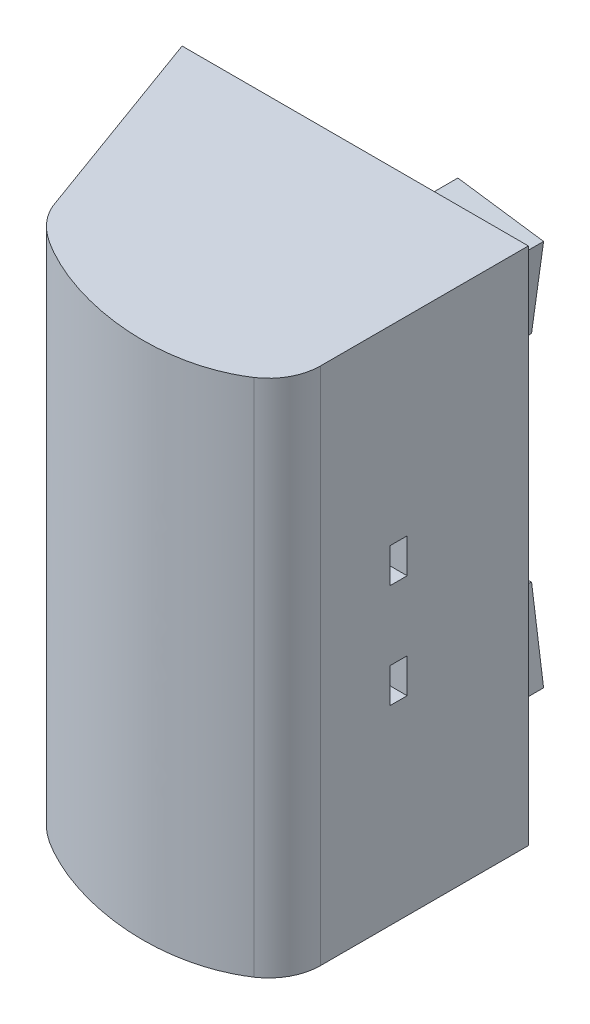
ISO-10303-21;
HEADER;
FILE_DESCRIPTION(('STEP AP214'),'2;1');
FILE_NAME('part.step','',(''),(''),'','','');
FILE_SCHEMA(('AUTOMOTIVE_DESIGN { 1 0 10303 214 1 1 1 1 }'));
ENDSEC;
DATA;
#1=APPLICATION_CONTEXT('core data for automotive mechanical design processes');
#2=APPLICATION_PROTOCOL_DEFINITION('international standard','automotive_design',2000,#1);
#3=PRODUCT_CONTEXT('',#1,'mechanical');
#4=PRODUCT('Part','Part','',(#3));
#5=PRODUCT_RELATED_PRODUCT_CATEGORY('part','',(#4));
#6=PRODUCT_DEFINITION_FORMATION('','',#4);
#7=PRODUCT_DEFINITION_CONTEXT('part definition',#1,'design');
#8=PRODUCT_DEFINITION('design','',#6,#7);
#9=PRODUCT_DEFINITION_SHAPE('','',#8);
#10=(LENGTH_UNIT() NAMED_UNIT(*) SI_UNIT(.MILLI.,.METRE.));
#11=(NAMED_UNIT(*) PLANE_ANGLE_UNIT() SI_UNIT($,.RADIAN.));
#12=(NAMED_UNIT(*) SI_UNIT($,.STERADIAN.) SOLID_ANGLE_UNIT());
#13=UNCERTAINTY_MEASURE_WITH_UNIT(LENGTH_MEASURE(1.E-05),#10,'distance_accuracy_value','');
#14=(GEOMETRIC_REPRESENTATION_CONTEXT(3) GLOBAL_UNCERTAINTY_ASSIGNED_CONTEXT((#13)) GLOBAL_UNIT_ASSIGNED_CONTEXT((#10,
#11,#12)) REPRESENTATION_CONTEXT('',''));
#15=CARTESIAN_POINT('',(0.,0.,0.));
#16=DIRECTION('',(0.,0.,1.));
#17=DIRECTION('',(1.,0.,0.));
#18=AXIS2_PLACEMENT_3D('',#15,#16,#17);
#19=CARTESIAN_POINT('',(0.,60.,0.));
#20=DIRECTION('',(0.,0.,-1.));
#21=DIRECTION('',(-1.,0.,0.));
#22=AXIS2_PLACEMENT_3D('',#19,#20,#21);
#23=PLANE('',#22);
#24=CARTESIAN_POINT('',(34.,24.,0.));
#25=DIRECTION('',(0.,0.,1.));
#26=DIRECTION('',(1.,0.,0.));
#27=AXIS2_PLACEMENT_3D('',#24,#25,#26);
#28=CIRCLE('',#27,2.6);
#29=CARTESIAN_POINT('',(36.6,24.,0.));
#30=VERTEX_POINT('',#29);
#31=EDGE_CURVE('E448',#30,#30,#28,.T.);
#32=ORIENTED_EDGE('',*,*,#31,.T.);
#33=EDGE_LOOP('',(#32));
#34=FACE_BOUND('',#33,.T.);
#35=CARTESIAN_POINT('',(34.,36.,0.));
#36=DIRECTION('',(0.,0.,1.));
#37=DIRECTION('',(1.,0.,0.));
#38=AXIS2_PLACEMENT_3D('',#35,#36,#37);
#39=CIRCLE('',#38,2.6);
#40=CARTESIAN_POINT('',(36.6,36.,0.));
#41=VERTEX_POINT('',#40);
#42=EDGE_CURVE('E453',#41,#41,#39,.T.);
#43=ORIENTED_EDGE('',*,*,#42,.T.);
#44=EDGE_LOOP('',(#43));
#45=FACE_BOUND('',#44,.T.);
#46=DIRECTION('',(1.,0.,0.));
#47=VECTOR('',#46,1.);
#48=CARTESIAN_POINT('',(0.,0.,0.));
#49=LINE('',#48,#47);
#50=CARTESIAN_POINT('',(0.,0.,0.));
#51=VERTEX_POINT('',#50);
#52=CARTESIAN_POINT('',(40.,0.,0.));
#53=VERTEX_POINT('',#52);
#54=EDGE_CURVE('E313',#51,#53,#49,.T.);
#55=ORIENTED_EDGE('',*,*,#54,.F.);
#56=DIRECTION('',(0.,-1.,0.));
#57=VECTOR('',#56,1.);
#58=CARTESIAN_POINT('',(0.,60.,0.));
#59=LINE('',#58,#57);
#60=CARTESIAN_POINT('',(0.,60.,0.));
#61=VERTEX_POINT('',#60);
#62=EDGE_CURVE('E500',#61,#51,#59,.T.);
#63=ORIENTED_EDGE('',*,*,#62,.F.);
#64=DIRECTION('',(1.,0.,0.));
#65=VECTOR('',#64,1.);
#66=CARTESIAN_POINT('',(0.,60.,0.));
#67=LINE('',#66,#65);
#68=CARTESIAN_POINT('',(40.,60.,0.));
#69=VERTEX_POINT('',#68);
#70=EDGE_CURVE('E502',#61,#69,#67,.T.);
#71=ORIENTED_EDGE('',*,*,#70,.T.);
#72=DIRECTION('',(0.,-1.,0.));
#73=VECTOR('',#72,1.);
#74=CARTESIAN_POINT('',(40.,60.,0.));
#75=LINE('',#74,#73);
#76=EDGE_CURVE('E498',#69,#53,#75,.T.);
#77=ORIENTED_EDGE('',*,*,#76,.T.);
#78=EDGE_LOOP('',(#55,#63,#71,#77));
#79=FACE_BOUND('',#78,.T.);
#80=DIRECTION('',(0.139173100960059,-0.990268068741571,0.));
#81=VECTOR('',#80,1.);
#82=CARTESIAN_POINT('',(31.3691003651649,17.5712857341904,0.));
#83=LINE('',#82,#81);
#84=CARTESIAN_POINT('',(31.3691003651649,17.5712857341904,0.));
#85=VERTEX_POINT('',#84);
#86=CARTESIAN_POINT('',(32.7608313747655,7.66860504677466,0.));
#87=VERTEX_POINT('',#86);
#88=EDGE_CURVE('E209',#85,#87,#83,.T.);
#89=ORIENTED_EDGE('',*,*,#88,.F.);
#90=DIRECTION('',(0.990268068741571,0.13917310096006,0.));
#91=VECTOR('',#90,1.);
#92=CARTESIAN_POINT('',(31.3691003651649,17.5712857341904,0.));
#93=LINE('',#92,#91);
#94=CARTESIAN_POINT('',(21.4664196777491,16.1795547245898,0.));
#95=VERTEX_POINT('',#94);
#96=EDGE_CURVE('E206',#95,#85,#93,.T.);
#97=ORIENTED_EDGE('',*,*,#96,.F.);
#98=DIRECTION('',(-0.139173100960059,0.990268068741571,0.));
#99=VECTOR('',#98,1.);
#100=CARTESIAN_POINT('',(21.4664196777491,16.1795547245898,0.));
#101=LINE('',#100,#99);
#102=CARTESIAN_POINT('',(22.8581506873497,6.27687403717406,0.));
#103=VERTEX_POINT('',#102);
#104=EDGE_CURVE('E218',#103,#95,#101,.T.);
#105=ORIENTED_EDGE('',*,*,#104,.F.);
#106=DIRECTION('',(-0.990268068741571,-0.139173100960059,0.));
#107=VECTOR('',#106,1.);
#108=CARTESIAN_POINT('',(22.8581506873497,6.27687403717406,0.));
#109=LINE('',#108,#107);
#110=EDGE_CURVE('E226',#87,#103,#109,.T.);
#111=ORIENTED_EDGE('',*,*,#110,.F.);
#112=EDGE_LOOP('',(#89,#97,#105,#111));
#113=FACE_BOUND('',#112,.T.);
#114=DIRECTION('',(0.139173100960059,0.990268068741571,0.));
#115=VECTOR('',#114,1.);
#116=CARTESIAN_POINT('',(21.4664196777491,43.8204452754102,0.));
#117=LINE('',#116,#115);
#118=CARTESIAN_POINT('',(21.4664196777491,43.8204452754102,0.));
#119=VERTEX_POINT('',#118);
#120=CARTESIAN_POINT('',(22.8581506873497,53.7231259628259,0.));
#121=VERTEX_POINT('',#120);
#122=EDGE_CURVE('E466',#119,#121,#117,.T.);
#123=ORIENTED_EDGE('',*,*,#122,.F.);
#124=DIRECTION('',(-0.990268068741571,0.13917310096006,0.));
#125=VECTOR('',#124,1.);
#126=CARTESIAN_POINT('',(31.3691003651649,42.4287142658096,0.));
#127=LINE('',#126,#125);
#128=CARTESIAN_POINT('',(31.3691003651649,42.4287142658096,0.));
#129=VERTEX_POINT('',#128);
#130=EDGE_CURVE('E204',#129,#119,#127,.T.);
#131=ORIENTED_EDGE('',*,*,#130,.F.);
#132=DIRECTION('',(-0.139173100960059,-0.990268068741571,0.));
#133=VECTOR('',#132,1.);
#134=CARTESIAN_POINT('',(31.3691003651649,42.4287142658096,0.));
#135=LINE('',#134,#133);
#136=CARTESIAN_POINT('',(32.7608313747655,52.3313949532253,0.));
#137=VERTEX_POINT('',#136);
#138=EDGE_CURVE('E200',#137,#129,#135,.T.);
#139=ORIENTED_EDGE('',*,*,#138,.F.);
#140=DIRECTION('',(0.990268068741571,-0.139173100960059,0.));
#141=VECTOR('',#140,1.);
#142=CARTESIAN_POINT('',(22.8581506873497,53.7231259628259,0.));
#143=LINE('',#142,#141);
#144=EDGE_CURVE('E468',#121,#137,#143,.T.);
#145=ORIENTED_EDGE('',*,*,#144,.F.);
#146=EDGE_LOOP('',(#123,#131,#139,#145));
#147=FACE_BOUND('',#146,.T.);
#148=ADVANCED_FACE('F35',(#34,#45,#79,#113,#147),#23,.T.);
#149=CARTESIAN_POINT('',(34.,24.,20.));
#150=DIRECTION('',(0.,0.,-1.));
#151=DIRECTION('',(-1.,0.,0.));
#152=AXIS2_PLACEMENT_3D('',#149,#150,#151);
#153=CYLINDRICAL_SURFACE('',#152,1.6);
#154=CARTESIAN_POINT('',(34.,24.,14.));
#155=DIRECTION('',(0.,0.,-1.));
#156=DIRECTION('',(0.,1.,0.));
#157=AXIS2_PLACEMENT_3D('',#154,#155,#156);
#158=CIRCLE('',#157,1.6);
#159=CARTESIAN_POINT('',(34.,25.6,14.));
#160=VERTEX_POINT('',#159);
#161=EDGE_CURVE('E39',#160,#160,#158,.F.);
#162=ORIENTED_EDGE('',*,*,#161,.T.);
#163=EDGE_LOOP('',(#162));
#164=FACE_BOUND('',#163,.T.);
#165=CARTESIAN_POINT('',(34.,24.,-2.));
#166=DIRECTION('',(0.,0.,1.));
#167=DIRECTION('',(1.,0.,0.));
#168=AXIS2_PLACEMENT_3D('',#165,#166,#167);
#169=CIRCLE('',#168,1.6);
#170=CARTESIAN_POINT('',(35.6,24.,-2.));
#171=VERTEX_POINT('',#170);
#172=EDGE_CURVE('E451',#171,#171,#169,.T.);
#173=ORIENTED_EDGE('',*,*,#172,.F.);
#174=EDGE_LOOP('',(#173));
#175=FACE_BOUND('',#174,.T.);
#176=ADVANCED_FACE('F338',(#164,#175),#153,.F.);
#177=CARTESIAN_POINT('',(34.,36.,20.));
#178=DIRECTION('',(0.,0.,-1.));
#179=DIRECTION('',(-1.,0.,0.));
#180=AXIS2_PLACEMENT_3D('',#177,#178,#179);
#181=CYLINDRICAL_SURFACE('',#180,1.6);
#182=CARTESIAN_POINT('',(34.,36.,14.));
#183=DIRECTION('',(0.,0.,-1.));
#184=DIRECTION('',(-1.,0.,0.));
#185=AXIS2_PLACEMENT_3D('',#182,#183,#184);
#186=CIRCLE('',#185,1.6);
#187=CARTESIAN_POINT('',(32.4,36.,14.));
#188=VERTEX_POINT('',#187);
#189=EDGE_CURVE('E487',#188,#188,#186,.F.);
#190=ORIENTED_EDGE('',*,*,#189,.T.);
#191=EDGE_LOOP('',(#190));
#192=FACE_BOUND('',#191,.T.);
#193=CARTESIAN_POINT('',(34.,36.,-2.));
#194=DIRECTION('',(0.,0.,1.));
#195=DIRECTION('',(1.,0.,0.));
#196=AXIS2_PLACEMENT_3D('',#193,#194,#195);
#197=CIRCLE('',#196,1.6);
#198=CARTESIAN_POINT('',(35.6,36.,-2.));
#199=VERTEX_POINT('',#198);
#200=EDGE_CURVE('E456',#199,#199,#197,.T.);
#201=ORIENTED_EDGE('',*,*,#200,.F.);
#202=EDGE_LOOP('',(#201));
#203=FACE_BOUND('',#202,.T.);
#204=ADVANCED_FACE('F362',(#192,#203),#181,.F.);
#205=CARTESIAN_POINT('',(0.,60.,0.));
#206=DIRECTION('',(0.939692620785909,0.,-0.342020143325666));
#207=DIRECTION('',(-0.342020143325666,0.,-0.939692620785909));
#208=AXIS2_PLACEMENT_3D('',#205,#206,#207);
#209=PLANE('',#208);
#210=DIRECTION('',(0.342020143325666,0.,0.93969262078591));
#211=VECTOR('',#210,1.);
#212=CARTESIAN_POINT('',(0.,0.,0.));
#213=LINE('',#212,#211);
#214=CARTESIAN_POINT('',(8.55050358314165,0.,23.4923155196477));
#215=VERTEX_POINT('',#214);
#216=EDGE_CURVE('E305',#51,#215,#213,.T.);
#217=ORIENTED_EDGE('',*,*,#216,.T.);
#218=DIRECTION('',(0.,-1.,0.));
#219=VECTOR('',#218,1.);
#220=CARTESIAN_POINT('',(8.55050358314165,60.,23.4923155196477));
#221=LINE('',#220,#219);
#222=CARTESIAN_POINT('',(8.55050358314165,60.,23.4923155196477));
#223=VERTEX_POINT('',#222);
#224=EDGE_CURVE('E11',#223,#215,#221,.T.);
#225=ORIENTED_EDGE('',*,*,#224,.F.);
#226=DIRECTION('',(0.342020143325666,0.,0.93969262078591));
#227=VECTOR('',#226,1.);
#228=CARTESIAN_POINT('',(0.,60.,0.));
#229=LINE('',#228,#227);
#230=EDGE_CURVE('E309',#61,#223,#229,.T.);
#231=ORIENTED_EDGE('',*,*,#230,.F.);
#232=ORIENTED_EDGE('',*,*,#62,.T.);
#233=EDGE_LOOP('',(#217,#225,#231,#232));
#234=FACE_BOUND('',#233,.T.);
#235=ADVANCED_FACE('F37',(#234),#209,.F.);
#236=CARTESIAN_POINT('',(8.55050358314165,60.,23.4923155196477));
#237=CARTESIAN_POINT('',(9.18765074699314,60.,24.9849829137062));
#238=CARTESIAN_POINT('',(10.8690334950303,60.,26.6958688574846));
#239=CARTESIAN_POINT('',(13.5799434538811,60.,28.2755265891306));
#240=CARTESIAN_POINT('',(21.4201873768036,60.,32.0809754041825));
#241=CARTESIAN_POINT('',(31.2886114496521,60.,32.9569638078628));
#242=CARTESIAN_POINT('',(37.3305271650823,60.,28.9953986145493));
#243=B_SPLINE_CURVE_WITH_KNOTS('',3,(#236,#237,#238,#239,#240,#241,#242),.UNSPECIFIED.,.F.,.F.,
(4,1,1,1,4),(0.,0.152199330225797,0.226855665368492,0.301953475738041,1.),.UNSPECIFIED.);
#244=DIRECTION('',(0.,-1.,0.));
#245=VECTOR('',#244,1.);
#246=SURFACE_OF_LINEAR_EXTRUSION('',#243,#245);
#247=CARTESIAN_POINT('',(8.55050358314165,0.,23.4923155196477));
#248=CARTESIAN_POINT('',(9.18765074699314,0.,24.9849829137062));
#249=CARTESIAN_POINT('',(10.8690334950303,0.,26.6958688574846));
#250=CARTESIAN_POINT('',(13.5799434538811,0.,28.2755265891306));
#251=CARTESIAN_POINT('',(21.4201873768036,0.,32.0809754041825));
#252=CARTESIAN_POINT('',(31.2886114496521,0.,32.9569638078628));
#253=CARTESIAN_POINT('',(37.3305271650823,0.,28.9953986145493));
#254=B_SPLINE_CURVE_WITH_KNOTS('',3,(#247,#248,#249,#250,#251,#252,#253),.UNSPECIFIED.,.F.,.F.,
(4,1,1,1,4),(0.,0.152199330225797,0.226855665368492,0.301953475738041,1.),.UNSPECIFIED.);
#255=CARTESIAN_POINT('',(37.3305271650823,0.,28.9953986145493));
#256=VERTEX_POINT('',#255);
#257=EDGE_CURVE('E511',#215,#256,#254,.T.);
#258=ORIENTED_EDGE('',*,*,#257,.T.);
#259=DIRECTION('',(0.,-1.,0.));
#260=VECTOR('',#259,1.);
#261=CARTESIAN_POINT('',(37.3305271650823,60.,28.9953986145493));
#262=LINE('',#261,#260);
#263=CARTESIAN_POINT('',(37.3305271650823,60.,28.9953986145493));
#264=VERTEX_POINT('',#263);
#265=EDGE_CURVE('E44',#264,#256,#262,.T.);
#266=ORIENTED_EDGE('',*,*,#265,.F.);
#267=EDGE_CURVE('E312',#223,#264,#243,.T.);
#268=ORIENTED_EDGE('',*,*,#267,.F.);
#269=ORIENTED_EDGE('',*,*,#224,.T.);
#270=EDGE_LOOP('',(#258,#266,#268,#269));
#271=FACE_BOUND('',#270,.T.);
#272=ADVANCED_FACE('F323',(#271),#246,.F.);
#273=CARTESIAN_POINT('',(34.01,60.,24.01));
#274=DIRECTION('',(0.,-1.,0.));
#275=DIRECTION('',(0.,0.,-1.));
#276=AXIS2_PLACEMENT_3D('',#273,#274,#275);
#277=CYLINDRICAL_SURFACE('',#276,5.99);
#278=CARTESIAN_POINT('',(34.01,0.,24.01));
#279=DIRECTION('',(0.,1.,0.));
#280=DIRECTION('',(0.,0.,1.));
#281=AXIS2_PLACEMENT_3D('',#278,#279,#280);
#282=CIRCLE('',#281,5.99);
#283=CARTESIAN_POINT('',(40.,0.,24.01));
#284=VERTEX_POINT('',#283);
#285=EDGE_CURVE('E508',#284,#256,#282,.F.);
#286=ORIENTED_EDGE('',*,*,#285,.F.);
#287=DIRECTION('',(0.,-1.,0.));
#288=VECTOR('',#287,1.);
#289=CARTESIAN_POINT('',(40.,60.,24.01));
#290=LINE('',#289,#288);
#291=CARTESIAN_POINT('',(40.,60.,24.01));
#292=VERTEX_POINT('',#291);
#293=EDGE_CURVE('E496',#292,#284,#290,.T.);
#294=ORIENTED_EDGE('',*,*,#293,.F.);
#295=CARTESIAN_POINT('',(34.01,60.,24.01));
#296=DIRECTION('',(0.,1.,0.));
#297=DIRECTION('',(0.,0.,1.));
#298=AXIS2_PLACEMENT_3D('',#295,#296,#297);
#299=CIRCLE('',#298,5.99);
#300=EDGE_CURVE('E318',#292,#264,#299,.F.);
#301=ORIENTED_EDGE('',*,*,#300,.T.);
#302=ORIENTED_EDGE('',*,*,#265,.T.);
#303=EDGE_LOOP('',(#286,#294,#301,#302));
#304=FACE_BOUND('',#303,.T.);
#305=ADVANCED_FACE('F326',(#304),#277,.T.);
#306=CARTESIAN_POINT('',(40.,60.,0.));
#307=DIRECTION('',(1.,0.,0.));
#308=DIRECTION('',(0.,0.,-1.));
#309=AXIS2_PLACEMENT_3D('',#306,#307,#308);
#310=PLANE('',#309);
#311=DIRECTION('',(0.,1.,0.));
#312=VECTOR('',#311,1.);
#313=CARTESIAN_POINT('',(40.,34.,14.));
#314=LINE('',#313,#312);
#315=CARTESIAN_POINT('',(40.,34.,14.));
#316=VERTEX_POINT('',#315);
#317=CARTESIAN_POINT('',(40.,38.,14.));
#318=VERTEX_POINT('',#317);
#319=EDGE_CURVE('E252',#316,#318,#314,.T.);
#320=ORIENTED_EDGE('',*,*,#319,.F.);
#321=DIRECTION('',(0.,0.,-1.));
#322=VECTOR('',#321,1.);
#323=CARTESIAN_POINT('',(40.,34.,14.));
#324=LINE('',#323,#322);
#325=CARTESIAN_POINT('',(40.,34.,16.));
#326=VERTEX_POINT('',#325);
#327=EDGE_CURVE('E242',#326,#316,#324,.T.);
#328=ORIENTED_EDGE('',*,*,#327,.F.);
#329=DIRECTION('',(0.,-1.,0.));
#330=VECTOR('',#329,1.);
#331=CARTESIAN_POINT('',(40.,34.,16.));
#332=LINE('',#331,#330);
#333=CARTESIAN_POINT('',(40.,38.,16.));
#334=VERTEX_POINT('',#333);
#335=EDGE_CURVE('E258',#334,#326,#332,.T.);
#336=ORIENTED_EDGE('',*,*,#335,.F.);
#337=DIRECTION('',(0.,0.,1.));
#338=VECTOR('',#337,1.);
#339=CARTESIAN_POINT('',(40.,38.,14.));
#340=LINE('',#339,#338);
#341=EDGE_CURVE('E254',#318,#334,#340,.T.);
#342=ORIENTED_EDGE('',*,*,#341,.F.);
#343=EDGE_LOOP('',(#320,#328,#336,#342));
#344=FACE_BOUND('',#343,.T.);
#345=DIRECTION('',(0.,1.,0.));
#346=VECTOR('',#345,1.);
#347=CARTESIAN_POINT('',(40.,26.,14.));
#348=LINE('',#347,#346);
#349=CARTESIAN_POINT('',(40.,22.,14.));
#350=VERTEX_POINT('',#349);
#351=CARTESIAN_POINT('',(40.,26.,14.));
#352=VERTEX_POINT('',#351);
#353=EDGE_CURVE('E237',#350,#352,#348,.T.);
#354=ORIENTED_EDGE('',*,*,#353,.F.);
#355=DIRECTION('',(0.,0.,-1.));
#356=VECTOR('',#355,1.);
#357=CARTESIAN_POINT('',(40.,22.,14.));
#358=LINE('',#357,#356);
#359=CARTESIAN_POINT('',(40.,22.,16.));
#360=VERTEX_POINT('',#359);
#361=EDGE_CURVE('E276',#360,#350,#358,.T.);
#362=ORIENTED_EDGE('',*,*,#361,.F.);
#363=DIRECTION('',(0.,-1.,0.));
#364=VECTOR('',#363,1.);
#365=CARTESIAN_POINT('',(40.,26.,16.));
#366=LINE('',#365,#364);
#367=CARTESIAN_POINT('',(40.,26.,16.));
#368=VERTEX_POINT('',#367);
#369=EDGE_CURVE('E290',#368,#360,#366,.T.);
#370=ORIENTED_EDGE('',*,*,#369,.F.);
#371=DIRECTION('',(0.,0.,1.));
#372=VECTOR('',#371,1.);
#373=CARTESIAN_POINT('',(40.,26.,14.));
#374=LINE('',#373,#372);
#375=EDGE_CURVE('E287',#352,#368,#374,.T.);
#376=ORIENTED_EDGE('',*,*,#375,.F.);
#377=EDGE_LOOP('',(#354,#362,#370,#376));
#378=FACE_BOUND('',#377,.T.);
#379=DIRECTION('',(0.,0.,1.));
#380=VECTOR('',#379,1.);
#381=CARTESIAN_POINT('',(40.,0.,0.));
#382=LINE('',#381,#380);
#383=EDGE_CURVE('E505',#53,#284,#382,.T.);
#384=ORIENTED_EDGE('',*,*,#383,.F.);
#385=ORIENTED_EDGE('',*,*,#76,.F.);
#386=DIRECTION('',(0.,0.,1.));
#387=VECTOR('',#386,1.);
#388=CARTESIAN_POINT('',(40.,60.,0.));
#389=LINE('',#388,#387);
#390=EDGE_CURVE('E522',#69,#292,#389,.T.);
#391=ORIENTED_EDGE('',*,*,#390,.T.);
#392=ORIENTED_EDGE('',*,*,#293,.T.);
#393=EDGE_LOOP('',(#384,#385,#391,#392));
#394=FACE_BOUND('',#393,.T.);
#395=ADVANCED_FACE('F330',(#344,#378,#394),#310,.T.);
#396=CARTESIAN_POINT('',(0.,60.,0.));
#397=DIRECTION('',(0.,1.,0.));
#398=DIRECTION('',(0.,0.,1.));
#399=AXIS2_PLACEMENT_3D('',#396,#397,#398);
#400=PLANE('',#399);
#401=ORIENTED_EDGE('',*,*,#230,.T.);
#402=ORIENTED_EDGE('',*,*,#267,.T.);
#403=ORIENTED_EDGE('',*,*,#300,.F.);
#404=ORIENTED_EDGE('',*,*,#390,.F.);
#405=ORIENTED_EDGE('',*,*,#70,.F.);
#406=EDGE_LOOP('',(#401,#402,#403,#404,#405));
#407=FACE_BOUND('',#406,.T.);
#408=ADVANCED_FACE('F334',(#407),#400,.T.);
#409=CARTESIAN_POINT('',(0.,0.,0.));
#410=DIRECTION('',(0.,1.,0.));
#411=DIRECTION('',(0.,0.,1.));
#412=AXIS2_PLACEMENT_3D('',#409,#410,#411);
#413=PLANE('',#412);
#414=ORIENTED_EDGE('',*,*,#216,.F.);
#415=ORIENTED_EDGE('',*,*,#54,.T.);
#416=ORIENTED_EDGE('',*,*,#383,.T.);
#417=ORIENTED_EDGE('',*,*,#285,.T.);
#418=ORIENTED_EDGE('',*,*,#257,.F.);
#419=EDGE_LOOP('',(#414,#415,#416,#417,#418));
#420=FACE_BOUND('',#419,.T.);
#421=ADVANCED_FACE('F340',(#420),#413,.F.);
#422=CARTESIAN_POINT('',(30.,34.,14.));
#423=DIRECTION('',(0.,0.,-1.));
#424=DIRECTION('',(-1.,0.,0.));
#425=AXIS2_PLACEMENT_3D('',#422,#423,#424);
#426=PLANE('',#425);
#427=ORIENTED_EDGE('',*,*,#319,.T.);
#428=DIRECTION('',(1.,0.,0.));
#429=VECTOR('',#428,1.);
#430=CARTESIAN_POINT('',(30.,38.,14.));
#431=LINE('',#430,#429);
#432=CARTESIAN_POINT('',(30.,38.,14.));
#433=VERTEX_POINT('',#432);
#434=EDGE_CURVE('E251',#433,#318,#431,.T.);
#435=ORIENTED_EDGE('',*,*,#434,.F.);
#436=DIRECTION('',(0.,1.,0.));
#437=VECTOR('',#436,1.);
#438=CARTESIAN_POINT('',(30.,34.,14.));
#439=LINE('',#438,#437);
#440=CARTESIAN_POINT('',(30.,34.,14.));
#441=VERTEX_POINT('',#440);
#442=EDGE_CURVE('E238',#441,#433,#439,.T.);
#443=ORIENTED_EDGE('',*,*,#442,.F.);
#444=DIRECTION('',(1.,0.,0.));
#445=VECTOR('',#444,1.);
#446=CARTESIAN_POINT('',(30.,34.,14.));
#447=LINE('',#446,#445);
#448=EDGE_CURVE('E263',#441,#316,#447,.T.);
#449=ORIENTED_EDGE('',*,*,#448,.T.);
#450=EDGE_LOOP('',(#427,#435,#443,#449));
#451=FACE_BOUND('',#450,.T.);
#452=ORIENTED_EDGE('',*,*,#189,.F.);
#453=EDGE_LOOP('',(#452));
#454=FACE_BOUND('',#453,.T.);
#455=ADVANCED_FACE('F343',(#451,#454),#426,.F.);
#456=CARTESIAN_POINT('',(30.,34.,16.));
#457=DIRECTION('',(0.,0.,1.));
#458=DIRECTION('',(1.,0.,0.));
#459=AXIS2_PLACEMENT_3D('',#456,#457,#458);
#460=PLANE('',#459);
#461=ORIENTED_EDGE('',*,*,#335,.T.);
#462=DIRECTION('',(1.,0.,0.));
#463=VECTOR('',#462,1.);
#464=CARTESIAN_POINT('',(30.,34.,16.));
#465=LINE('',#464,#463);
#466=CARTESIAN_POINT('',(30.,34.,16.));
#467=VERTEX_POINT('',#466);
#468=EDGE_CURVE('E266',#467,#326,#465,.T.);
#469=ORIENTED_EDGE('',*,*,#468,.F.);
#470=DIRECTION('',(0.,-1.,0.));
#471=VECTOR('',#470,1.);
#472=CARTESIAN_POINT('',(30.,34.,16.));
#473=LINE('',#472,#471);
#474=CARTESIAN_POINT('',(30.,38.,16.));
#475=VERTEX_POINT('',#474);
#476=EDGE_CURVE('E245',#475,#467,#473,.T.);
#477=ORIENTED_EDGE('',*,*,#476,.F.);
#478=DIRECTION('',(1.,0.,0.));
#479=VECTOR('',#478,1.);
#480=CARTESIAN_POINT('',(30.,38.,16.));
#481=LINE('',#480,#479);
#482=EDGE_CURVE('E268',#475,#334,#481,.T.);
#483=ORIENTED_EDGE('',*,*,#482,.T.);
#484=EDGE_LOOP('',(#461,#469,#477,#483));
#485=FACE_BOUND('',#484,.T.);
#486=CARTESIAN_POINT('',(34.,36.,16.));
#487=DIRECTION('',(0.,0.,1.));
#488=DIRECTION('',(1.,0.,0.));
#489=AXIS2_PLACEMENT_3D('',#486,#487,#488);
#490=CIRCLE('',#489,1.6);
#491=CARTESIAN_POINT('',(35.6,36.,16.));
#492=VERTEX_POINT('',#491);
#493=EDGE_CURVE('E265',#492,#492,#490,.F.);
#494=ORIENTED_EDGE('',*,*,#493,.F.);
#495=EDGE_LOOP('',(#494));
#496=FACE_BOUND('',#495,.T.);
#497=ADVANCED_FACE('F389',(#485,#496),#460,.F.);
#498=CARTESIAN_POINT('',(30.,34.,14.));
#499=DIRECTION('',(0.,-1.,0.));
#500=DIRECTION('',(0.,0.,-1.));
#501=AXIS2_PLACEMENT_3D('',#498,#499,#500);
#502=PLANE('',#501);
#503=ORIENTED_EDGE('',*,*,#327,.T.);
#504=ORIENTED_EDGE('',*,*,#448,.F.);
#505=DIRECTION('',(0.,0.,-1.));
#506=VECTOR('',#505,1.);
#507=CARTESIAN_POINT('',(30.,34.,14.));
#508=LINE('',#507,#506);
#509=EDGE_CURVE('E248',#467,#441,#508,.T.);
#510=ORIENTED_EDGE('',*,*,#509,.F.);
#511=ORIENTED_EDGE('',*,*,#468,.T.);
#512=EDGE_LOOP('',(#503,#504,#510,#511));
#513=FACE_BOUND('',#512,.T.);
#514=ADVANCED_FACE('F394',(#513),#502,.F.);
#515=CARTESIAN_POINT('',(30.,38.,14.));
#516=DIRECTION('',(0.,1.,0.));
#517=DIRECTION('',(0.,0.,1.));
#518=AXIS2_PLACEMENT_3D('',#515,#516,#517);
#519=PLANE('',#518);
#520=ORIENTED_EDGE('',*,*,#341,.T.);
#521=ORIENTED_EDGE('',*,*,#482,.F.);
#522=DIRECTION('',(0.,0.,1.));
#523=VECTOR('',#522,1.);
#524=CARTESIAN_POINT('',(30.,38.,14.));
#525=LINE('',#524,#523);
#526=EDGE_CURVE('E241',#433,#475,#525,.T.);
#527=ORIENTED_EDGE('',*,*,#526,.F.);
#528=ORIENTED_EDGE('',*,*,#434,.T.);
#529=EDGE_LOOP('',(#520,#521,#527,#528));
#530=FACE_BOUND('',#529,.T.);
#531=ADVANCED_FACE('F391',(#530),#519,.F.);
#532=CARTESIAN_POINT('',(30.,0.,0.));
#533=DIRECTION('',(1.,0.,0.));
#534=DIRECTION('',(0.,0.,-1.));
#535=AXIS2_PLACEMENT_3D('',#532,#533,#534);
#536=PLANE('',#535);
#537=ORIENTED_EDGE('',*,*,#442,.T.);
#538=ORIENTED_EDGE('',*,*,#526,.T.);
#539=ORIENTED_EDGE('',*,*,#476,.T.);
#540=ORIENTED_EDGE('',*,*,#509,.T.);
#541=EDGE_LOOP('',(#537,#538,#539,#540));
#542=FACE_BOUND('',#541,.T.);
#543=ADVANCED_FACE('F371',(#542),#536,.T.);
#544=CARTESIAN_POINT('',(30.,26.,14.));
#545=DIRECTION('',(0.,0.,-1.));
#546=DIRECTION('',(0.,1.,0.));
#547=AXIS2_PLACEMENT_3D('',#544,#545,#546);
#548=PLANE('',#547);
#549=ORIENTED_EDGE('',*,*,#353,.T.);
#550=DIRECTION('',(1.,0.,0.));
#551=VECTOR('',#550,1.);
#552=CARTESIAN_POINT('',(30.,26.,14.));
#553=LINE('',#552,#551);
#554=CARTESIAN_POINT('',(30.,26.,14.));
#555=VERTEX_POINT('',#554);
#556=EDGE_CURVE('E285',#555,#352,#553,.T.);
#557=ORIENTED_EDGE('',*,*,#556,.F.);
#558=DIRECTION('',(0.,1.,0.));
#559=VECTOR('',#558,1.);
#560=CARTESIAN_POINT('',(30.,26.,14.));
#561=LINE('',#560,#559);
#562=CARTESIAN_POINT('',(30.,22.,14.));
#563=VERTEX_POINT('',#562);
#564=EDGE_CURVE('E272',#563,#555,#561,.T.);
#565=ORIENTED_EDGE('',*,*,#564,.F.);
#566=DIRECTION('',(1.,0.,0.));
#567=VECTOR('',#566,1.);
#568=CARTESIAN_POINT('',(30.,22.,14.));
#569=LINE('',#568,#567);
#570=EDGE_CURVE('E255',#563,#350,#569,.T.);
#571=ORIENTED_EDGE('',*,*,#570,.T.);
#572=EDGE_LOOP('',(#549,#557,#565,#571));
#573=FACE_BOUND('',#572,.T.);
#574=ORIENTED_EDGE('',*,*,#161,.F.);
#575=EDGE_LOOP('',(#574));
#576=FACE_BOUND('',#575,.T.);
#577=ADVANCED_FACE('F367',(#573,#576),#548,.F.);
#578=CARTESIAN_POINT('',(30.,26.,16.));
#579=DIRECTION('',(0.,0.,1.));
#580=DIRECTION('',(0.,-1.,0.));
#581=AXIS2_PLACEMENT_3D('',#578,#579,#580);
#582=PLANE('',#581);
#583=ORIENTED_EDGE('',*,*,#369,.T.);
#584=DIRECTION('',(1.,0.,0.));
#585=VECTOR('',#584,1.);
#586=CARTESIAN_POINT('',(30.,22.,16.));
#587=LINE('',#586,#585);
#588=CARTESIAN_POINT('',(30.,22.,16.));
#589=VERTEX_POINT('',#588);
#590=EDGE_CURVE('E296',#589,#360,#587,.T.);
#591=ORIENTED_EDGE('',*,*,#590,.F.);
#592=DIRECTION('',(0.,-1.,0.));
#593=VECTOR('',#592,1.);
#594=CARTESIAN_POINT('',(30.,26.,16.));
#595=LINE('',#594,#593);
#596=CARTESIAN_POINT('',(30.,26.,16.));
#597=VERTEX_POINT('',#596);
#598=EDGE_CURVE('E279',#597,#589,#595,.T.);
#599=ORIENTED_EDGE('',*,*,#598,.F.);
#600=DIRECTION('',(1.,0.,0.));
#601=VECTOR('',#600,1.);
#602=CARTESIAN_POINT('',(30.,26.,16.));
#603=LINE('',#602,#601);
#604=EDGE_CURVE('E298',#597,#368,#603,.T.);
#605=ORIENTED_EDGE('',*,*,#604,.T.);
#606=EDGE_LOOP('',(#583,#591,#599,#605));
#607=FACE_BOUND('',#606,.T.);
#608=CARTESIAN_POINT('',(34.,24.,16.));
#609=DIRECTION('',(0.,0.,1.));
#610=DIRECTION('',(0.,-1.,0.));
#611=AXIS2_PLACEMENT_3D('',#608,#609,#610);
#612=CIRCLE('',#611,1.6);
#613=CARTESIAN_POINT('',(34.,22.4,16.));
#614=VERTEX_POINT('',#613);
#615=EDGE_CURVE('E489',#614,#614,#612,.F.);
#616=ORIENTED_EDGE('',*,*,#615,.F.);
#617=EDGE_LOOP('',(#616));
#618=FACE_BOUND('',#617,.T.);
#619=ADVANCED_FACE('F370',(#607,#618),#582,.F.);
#620=CARTESIAN_POINT('',(30.,22.,14.));
#621=DIRECTION('',(0.,-1.,0.));
#622=DIRECTION('',(0.,0.,-1.));
#623=AXIS2_PLACEMENT_3D('',#620,#621,#622);
#624=PLANE('',#623);
#625=ORIENTED_EDGE('',*,*,#361,.T.);
#626=ORIENTED_EDGE('',*,*,#570,.F.);
#627=DIRECTION('',(0.,0.,-1.));
#628=VECTOR('',#627,1.);
#629=CARTESIAN_POINT('',(30.,22.,14.));
#630=LINE('',#629,#628);
#631=EDGE_CURVE('E282',#589,#563,#630,.T.);
#632=ORIENTED_EDGE('',*,*,#631,.F.);
#633=ORIENTED_EDGE('',*,*,#590,.T.);
#634=EDGE_LOOP('',(#625,#626,#632,#633));
#635=FACE_BOUND('',#634,.T.);
#636=ADVANCED_FACE('F376',(#635),#624,.F.);
#637=CARTESIAN_POINT('',(30.,26.,14.));
#638=DIRECTION('',(0.,1.,0.));
#639=DIRECTION('',(0.,0.,1.));
#640=AXIS2_PLACEMENT_3D('',#637,#638,#639);
#641=PLANE('',#640);
#642=ORIENTED_EDGE('',*,*,#375,.T.);
#643=ORIENTED_EDGE('',*,*,#604,.F.);
#644=DIRECTION('',(0.,0.,1.));
#645=VECTOR('',#644,1.);
#646=CARTESIAN_POINT('',(30.,26.,14.));
#647=LINE('',#646,#645);
#648=EDGE_CURVE('E275',#555,#597,#647,.T.);
#649=ORIENTED_EDGE('',*,*,#648,.F.);
#650=ORIENTED_EDGE('',*,*,#556,.T.);
#651=EDGE_LOOP('',(#642,#643,#649,#650));
#652=FACE_BOUND('',#651,.T.);
#653=ADVANCED_FACE('F373',(#652),#641,.F.);
#654=CARTESIAN_POINT('',(30.,0.,0.));
#655=DIRECTION('',(-1.,0.,0.));
#656=DIRECTION('',(0.,0.,1.));
#657=AXIS2_PLACEMENT_3D('',#654,#655,#656);
#658=PLANE('',#657);
#659=ORIENTED_EDGE('',*,*,#564,.T.);
#660=ORIENTED_EDGE('',*,*,#648,.T.);
#661=ORIENTED_EDGE('',*,*,#598,.T.);
#662=ORIENTED_EDGE('',*,*,#631,.T.);
#663=EDGE_LOOP('',(#659,#660,#661,#662));
#664=FACE_BOUND('',#663,.T.);
#665=ADVANCED_FACE('F365',(#664),#658,.F.);
#666=CARTESIAN_POINT('',(34.,36.,20.));
#667=DIRECTION('',(0.,0.,-1.));
#668=DIRECTION('',(-1.,0.,0.));
#669=AXIS2_PLACEMENT_3D('',#666,#667,#668);
#670=PLANE('',#669);
#671=CARTESIAN_POINT('',(34.,36.,20.));
#672=DIRECTION('',(0.,0.,-1.));
#673=DIRECTION('',(-1.,0.,0.));
#674=AXIS2_PLACEMENT_3D('',#671,#672,#673);
#675=CIRCLE('',#674,1.6);
#676=CARTESIAN_POINT('',(32.4,36.,20.));
#677=VERTEX_POINT('',#676);
#678=EDGE_CURVE('E302',#677,#677,#675,.T.);
#679=ORIENTED_EDGE('',*,*,#678,.T.);
#680=EDGE_LOOP('',(#679));
#681=FACE_BOUND('',#680,.T.);
#682=ADVANCED_FACE('F360',(#681),#670,.T.);
#683=ORIENTED_EDGE('',*,*,#493,.T.);
#684=EDGE_LOOP('',(#683));
#685=FACE_BOUND('',#684,.T.);
#686=ORIENTED_EDGE('',*,*,#678,.F.);
#687=EDGE_LOOP('',(#686));
#688=FACE_BOUND('',#687,.T.);
#689=ADVANCED_FACE('F356',(#685,#688),#181,.F.);
#690=CARTESIAN_POINT('',(34.,24.,20.));
#691=DIRECTION('',(0.,0.,1.));
#692=DIRECTION('',(1.,0.,0.));
#693=AXIS2_PLACEMENT_3D('',#690,#691,#692);
#694=PLANE('',#693);
#695=CARTESIAN_POINT('',(34.,24.,20.));
#696=DIRECTION('',(0.,0.,-1.));
#697=DIRECTION('',(1.,0.,0.));
#698=AXIS2_PLACEMENT_3D('',#695,#696,#697);
#699=CIRCLE('',#698,1.6);
#700=CARTESIAN_POINT('',(35.6,24.,20.));
#701=VERTEX_POINT('',#700);
#702=EDGE_CURVE('E306',#701,#701,#699,.T.);
#703=ORIENTED_EDGE('',*,*,#702,.T.);
#704=EDGE_LOOP('',(#703));
#705=FACE_BOUND('',#704,.T.);
#706=ADVANCED_FACE('F352',(#705),#694,.F.);
#707=ORIENTED_EDGE('',*,*,#615,.T.);
#708=EDGE_LOOP('',(#707));
#709=FACE_BOUND('',#708,.T.);
#710=ORIENTED_EDGE('',*,*,#702,.F.);
#711=EDGE_LOOP('',(#710));
#712=FACE_BOUND('',#711,.T.);
#713=ADVANCED_FACE('F348',(#709,#712),#153,.F.);
#714=CARTESIAN_POINT('',(31.3691003651649,17.5712857341904,-9.));
#715=DIRECTION('',(0.13917310096006,-0.990268068741571,0.));
#716=DIRECTION('',(0.990268068741571,0.13917310096006,0.));
#717=AXIS2_PLACEMENT_3D('',#714,#715,#716);
#718=PLANE('',#717);
#719=ORIENTED_EDGE('',*,*,#96,.T.);
#720=DIRECTION('',(0.,0.,1.));
#721=VECTOR('',#720,1.);
#722=CARTESIAN_POINT('',(31.3691003651649,17.5712857341904,-9.));
#723=LINE('',#722,#721);
#724=CARTESIAN_POINT('',(31.3691003651649,17.5712857341904,-9.));
#725=VERTEX_POINT('',#724);
#726=EDGE_CURVE('E235',#725,#85,#723,.T.);
#727=ORIENTED_EDGE('',*,*,#726,.F.);
#728=DIRECTION('',(0.990268068741571,0.13917310096006,0.));
#729=VECTOR('',#728,1.);
#730=CARTESIAN_POINT('',(31.3691003651649,17.5712857341904,-9.));
#731=LINE('',#730,#729);
#732=CARTESIAN_POINT('',(21.4664196777491,16.1795547245898,-9.));
#733=VERTEX_POINT('',#732);
#734=EDGE_CURVE('E214',#733,#725,#731,.T.);
#735=ORIENTED_EDGE('',*,*,#734,.F.);
#736=DIRECTION('',(0.,0.,1.));
#737=VECTOR('',#736,1.);
#738=CARTESIAN_POINT('',(21.4664196777491,16.1795547245898,-9.));
#739=LINE('',#738,#737);
#740=EDGE_CURVE('E223',#733,#95,#739,.T.);
#741=ORIENTED_EDGE('',*,*,#740,.T.);
#742=EDGE_LOOP('',(#719,#727,#735,#741));
#743=FACE_BOUND('',#742,.T.);
#744=ADVANCED_FACE('F351',(#743),#718,.F.);
#745=CARTESIAN_POINT('',(31.3691003651649,17.5712857341904,-9.));
#746=DIRECTION('',(-0.990268068741571,-0.139173100960059,0.));
#747=DIRECTION('',(0.139173100960059,-0.990268068741571,0.));
#748=AXIS2_PLACEMENT_3D('',#745,#746,#747);
#749=PLANE('',#748);
#750=ORIENTED_EDGE('',*,*,#88,.T.);
#751=DIRECTION('',(0.,0.,1.));
#752=VECTOR('',#751,1.);
#753=CARTESIAN_POINT('',(32.7608313747655,7.66860504677466,-9.));
#754=LINE('',#753,#752);
#755=CARTESIAN_POINT('',(32.7608313747655,7.66860504677466,-9.));
#756=VERTEX_POINT('',#755);
#757=EDGE_CURVE('E232',#756,#87,#754,.T.);
#758=ORIENTED_EDGE('',*,*,#757,.F.);
#759=DIRECTION('',(0.139173100960059,-0.990268068741571,0.));
#760=VECTOR('',#759,1.);
#761=CARTESIAN_POINT('',(31.3691003651649,17.5712857341904,-9.));
#762=LINE('',#761,#760);
#763=EDGE_CURVE('E217',#725,#756,#762,.T.);
#764=ORIENTED_EDGE('',*,*,#763,.F.);
#765=ORIENTED_EDGE('',*,*,#726,.T.);
#766=EDGE_LOOP('',(#750,#758,#764,#765));
#767=FACE_BOUND('',#766,.T.);
#768=ADVANCED_FACE('F407',(#767),#749,.F.);
#769=CARTESIAN_POINT('',(22.8581506873497,6.27687403717406,-9.));
#770=DIRECTION('',(-0.139173100960059,0.990268068741571,0.));
#771=DIRECTION('',(-0.990268068741571,-0.139173100960059,0.));
#772=AXIS2_PLACEMENT_3D('',#769,#770,#771);
#773=PLANE('',#772);
#774=ORIENTED_EDGE('',*,*,#110,.T.);
#775=DIRECTION('',(0.,0.,1.));
#776=VECTOR('',#775,1.);
#777=CARTESIAN_POINT('',(22.8581506873497,6.27687403717406,-9.));
#778=LINE('',#777,#776);
#779=CARTESIAN_POINT('',(22.8581506873497,6.27687403717406,-9.));
#780=VERTEX_POINT('',#779);
#781=EDGE_CURVE('E60',#780,#103,#778,.T.);
#782=ORIENTED_EDGE('',*,*,#781,.F.);
#783=DIRECTION('',(-0.990268068741571,-0.139173100960059,0.));
#784=VECTOR('',#783,1.);
#785=CARTESIAN_POINT('',(22.8581506873497,6.27687403717406,-9.));
#786=LINE('',#785,#784);
#787=EDGE_CURVE('E220',#756,#780,#786,.T.);
#788=ORIENTED_EDGE('',*,*,#787,.F.);
#789=ORIENTED_EDGE('',*,*,#757,.T.);
#790=EDGE_LOOP('',(#774,#782,#788,#789));
#791=FACE_BOUND('',#790,.T.);
#792=ADVANCED_FACE('F411',(#791),#773,.F.);
#793=CARTESIAN_POINT('',(21.4664196777491,16.1795547245898,-9.));
#794=DIRECTION('',(0.990268068741571,0.139173100960059,0.));
#795=DIRECTION('',(-0.139173100960059,0.990268068741571,0.));
#796=AXIS2_PLACEMENT_3D('',#793,#794,#795);
#797=PLANE('',#796);
#798=ORIENTED_EDGE('',*,*,#104,.T.);
#799=ORIENTED_EDGE('',*,*,#740,.F.);
#800=DIRECTION('',(-0.139173100960059,0.990268068741571,0.));
#801=VECTOR('',#800,1.);
#802=CARTESIAN_POINT('',(21.4664196777491,16.1795547245898,-9.));
#803=LINE('',#802,#801);
#804=EDGE_CURVE('E222',#780,#733,#803,.T.);
#805=ORIENTED_EDGE('',*,*,#804,.F.);
#806=ORIENTED_EDGE('',*,*,#781,.T.);
#807=EDGE_LOOP('',(#798,#799,#805,#806));
#808=FACE_BOUND('',#807,.T.);
#809=ADVANCED_FACE('F415',(#808),#797,.F.);
#810=CARTESIAN_POINT('',(0.,0.,-9.));
#811=DIRECTION('',(0.,0.,1.));
#812=DIRECTION('',(1.,0.,0.));
#813=AXIS2_PLACEMENT_3D('',#810,#811,#812);
#814=PLANE('',#813);
#815=ORIENTED_EDGE('',*,*,#734,.T.);
#816=ORIENTED_EDGE('',*,*,#763,.T.);
#817=ORIENTED_EDGE('',*,*,#787,.T.);
#818=ORIENTED_EDGE('',*,*,#804,.T.);
#819=EDGE_LOOP('',(#815,#816,#817,#818));
#820=FACE_BOUND('',#819,.T.);
#821=ADVANCED_FACE('F419',(#820),#814,.F.);
#822=CARTESIAN_POINT('',(31.3691003651649,42.4287142658096,-9.));
#823=DIRECTION('',(0.13917310096006,0.990268068741571,0.));
#824=DIRECTION('',(-0.990268068741571,0.13917310096006,0.));
#825=AXIS2_PLACEMENT_3D('',#822,#823,#824);
#826=PLANE('',#825);
#827=ORIENTED_EDGE('',*,*,#130,.T.);
#828=DIRECTION('',(0.,0.,1.));
#829=VECTOR('',#828,1.);
#830=CARTESIAN_POINT('',(21.4664196777491,43.8204452754102,-9.));
#831=LINE('',#830,#829);
#832=CARTESIAN_POINT('',(21.4664196777491,43.8204452754102,-9.));
#833=VERTEX_POINT('',#832);
#834=EDGE_CURVE('E185',#833,#119,#831,.T.);
#835=ORIENTED_EDGE('',*,*,#834,.F.);
#836=DIRECTION('',(-0.990268068741571,0.13917310096006,0.));
#837=VECTOR('',#836,1.);
#838=CARTESIAN_POINT('',(31.3691003651649,42.4287142658096,-9.));
#839=LINE('',#838,#837);
#840=CARTESIAN_POINT('',(31.3691003651649,42.4287142658096,-9.));
#841=VERTEX_POINT('',#840);
#842=EDGE_CURVE('E192',#841,#833,#839,.T.);
#843=ORIENTED_EDGE('',*,*,#842,.F.);
#844=DIRECTION('',(0.,0.,1.));
#845=VECTOR('',#844,1.);
#846=CARTESIAN_POINT('',(31.3691003651649,42.4287142658096,-9.));
#847=LINE('',#846,#845);
#848=EDGE_CURVE('E464',#841,#129,#847,.T.);
#849=ORIENTED_EDGE('',*,*,#848,.T.);
#850=EDGE_LOOP('',(#827,#835,#843,#849));
#851=FACE_BOUND('',#850,.T.);
#852=ADVANCED_FACE('F202',(#851),#826,.F.);
#853=CARTESIAN_POINT('',(21.4664196777491,43.8204452754102,-9.));
#854=DIRECTION('',(0.990268068741571,-0.139173100960059,0.));
#855=DIRECTION('',(0.139173100960059,0.990268068741571,0.));
#856=AXIS2_PLACEMENT_3D('',#853,#854,#855);
#857=PLANE('',#856);
#858=ORIENTED_EDGE('',*,*,#122,.T.);
#859=DIRECTION('',(0.,0.,1.));
#860=VECTOR('',#859,1.);
#861=CARTESIAN_POINT('',(22.8581506873497,53.7231259628259,-9.));
#862=LINE('',#861,#860);
#863=CARTESIAN_POINT('',(22.8581506873497,53.7231259628259,-9.));
#864=VERTEX_POINT('',#863);
#865=EDGE_CURVE('E188',#864,#121,#862,.T.);
#866=ORIENTED_EDGE('',*,*,#865,.F.);
#867=DIRECTION('',(0.139173100960059,0.990268068741571,0.));
#868=VECTOR('',#867,1.);
#869=CARTESIAN_POINT('',(21.4664196777491,43.8204452754102,-9.));
#870=LINE('',#869,#868);
#871=EDGE_CURVE('E181',#833,#864,#870,.T.);
#872=ORIENTED_EDGE('',*,*,#871,.F.);
#873=ORIENTED_EDGE('',*,*,#834,.T.);
#874=EDGE_LOOP('',(#858,#866,#872,#873));
#875=FACE_BOUND('',#874,.T.);
#876=ADVANCED_FACE('F183',(#875),#857,.F.);
#877=CARTESIAN_POINT('',(22.8581506873497,53.7231259628259,-9.));
#878=DIRECTION('',(-0.139173100960059,-0.990268068741571,0.));
#879=DIRECTION('',(0.990268068741571,-0.139173100960059,0.));
#880=AXIS2_PLACEMENT_3D('',#877,#878,#879);
#881=PLANE('',#880);
#882=ORIENTED_EDGE('',*,*,#144,.T.);
#883=DIRECTION('',(0.,0.,1.));
#884=VECTOR('',#883,1.);
#885=CARTESIAN_POINT('',(32.7608313747655,52.3313949532253,-9.));
#886=LINE('',#885,#884);
#887=CARTESIAN_POINT('',(32.7608313747655,52.3313949532253,-9.));
#888=VERTEX_POINT('',#887);
#889=EDGE_CURVE('E52',#888,#137,#886,.T.);
#890=ORIENTED_EDGE('',*,*,#889,.F.);
#891=DIRECTION('',(0.990268068741571,-0.139173100960059,0.));
#892=VECTOR('',#891,1.);
#893=CARTESIAN_POINT('',(22.8581506873497,53.7231259628259,-9.));
#894=LINE('',#893,#892);
#895=EDGE_CURVE('E191',#864,#888,#894,.T.);
#896=ORIENTED_EDGE('',*,*,#895,.F.);
#897=ORIENTED_EDGE('',*,*,#865,.T.);
#898=EDGE_LOOP('',(#882,#890,#896,#897));
#899=FACE_BOUND('',#898,.T.);
#900=ADVANCED_FACE('F427',(#899),#881,.F.);
#901=CARTESIAN_POINT('',(31.3691003651649,42.4287142658096,-9.));
#902=DIRECTION('',(-0.990268068741571,0.139173100960059,0.));
#903=DIRECTION('',(-0.139173100960059,-0.990268068741571,0.));
#904=AXIS2_PLACEMENT_3D('',#901,#902,#903);
#905=PLANE('',#904);
#906=ORIENTED_EDGE('',*,*,#138,.T.);
#907=ORIENTED_EDGE('',*,*,#848,.F.);
#908=DIRECTION('',(-0.139173100960059,-0.990268068741571,0.));
#909=VECTOR('',#908,1.);
#910=CARTESIAN_POINT('',(31.3691003651649,42.4287142658096,-9.));
#911=LINE('',#910,#909);
#912=EDGE_CURVE('E196',#888,#841,#911,.T.);
#913=ORIENTED_EDGE('',*,*,#912,.F.);
#914=ORIENTED_EDGE('',*,*,#889,.T.);
#915=EDGE_LOOP('',(#906,#907,#913,#914));
#916=FACE_BOUND('',#915,.T.);
#917=ADVANCED_FACE('F430',(#916),#905,.F.);
#918=CARTESIAN_POINT('',(0.,0.,-9.));
#919=DIRECTION('',(0.,0.,-1.));
#920=DIRECTION('',(-1.,0.,0.));
#921=AXIS2_PLACEMENT_3D('',#918,#919,#920);
#922=PLANE('',#921);
#923=ORIENTED_EDGE('',*,*,#842,.T.);
#924=ORIENTED_EDGE('',*,*,#871,.T.);
#925=ORIENTED_EDGE('',*,*,#895,.T.);
#926=ORIENTED_EDGE('',*,*,#912,.T.);
#927=EDGE_LOOP('',(#923,#924,#925,#926));
#928=FACE_BOUND('',#927,.T.);
#929=ADVANCED_FACE('F195',(#928),#922,.T.);
#930=CARTESIAN_POINT('',(34.,36.,-2.));
#931=DIRECTION('',(0.,0.,1.));
#932=DIRECTION('',(1.,0.,0.));
#933=AXIS2_PLACEMENT_3D('',#930,#931,#932);
#934=CONICAL_SURFACE('',#933,1.6,0.463647609000806);
#935=ORIENTED_EDGE('',*,*,#42,.F.);
#936=EDGE_LOOP('',(#935));
#937=FACE_BOUND('',#936,.T.);
#938=ORIENTED_EDGE('',*,*,#200,.T.);
#939=EDGE_LOOP('',(#938));
#940=FACE_BOUND('',#939,.T.);
#941=ADVANCED_FACE('F436',(#937,#940),#934,.T.);
#942=CARTESIAN_POINT('',(34.,24.,-2.));
#943=DIRECTION('',(0.,0.,1.));
#944=DIRECTION('',(1.,0.,0.));
#945=AXIS2_PLACEMENT_3D('',#942,#943,#944);
#946=CONICAL_SURFACE('',#945,1.6,0.463647609000808);
#947=ORIENTED_EDGE('',*,*,#31,.F.);
#948=EDGE_LOOP('',(#947));
#949=FACE_BOUND('',#948,.T.);
#950=ORIENTED_EDGE('',*,*,#172,.T.);
#951=EDGE_LOOP('',(#950));
#952=FACE_BOUND('',#951,.T.);
#953=ADVANCED_FACE('F439',(#949,#952),#946,.T.);
#954=CLOSED_SHELL('',(#148,#176,#204,#235,#272,#305,#395,#408,#421,#455,#497,#514,#531,#543,
#577,#619,#636,#653,#665,#682,#689,#706,#713,#744,#768,#792,#809,#821,#852,#876,#900,#917,#929,
#941,#953));
#955=MANIFOLD_SOLID_BREP('B2',#954);
#956=ADVANCED_BREP_SHAPE_REPRESENTATION('',(#18,#955),#14);
#957=SHAPE_DEFINITION_REPRESENTATION(#9,#956);
ENDSEC;
END-ISO-10303-21;
